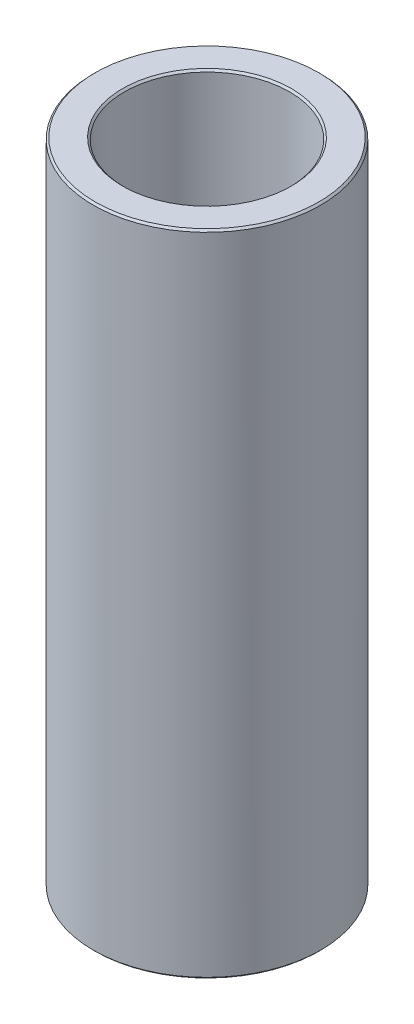
ISO-10303-21;
HEADER;
FILE_DESCRIPTION(('STEP AP214'),'2;1');
FILE_NAME('part.step','',(''),(''),'','','');
FILE_SCHEMA(('AUTOMOTIVE_DESIGN { 1 0 10303 214 1 1 1 1 }'));
ENDSEC;
DATA;
#1=APPLICATION_CONTEXT('core data for automotive mechanical design processes');
#2=APPLICATION_PROTOCOL_DEFINITION('international standard','automotive_design',2000,#1);
#3=PRODUCT_CONTEXT('',#1,'mechanical');
#4=PRODUCT('Part','Part','',(#3));
#5=PRODUCT_RELATED_PRODUCT_CATEGORY('part','',(#4));
#6=PRODUCT_DEFINITION_FORMATION('','',#4);
#7=PRODUCT_DEFINITION_CONTEXT('part definition',#1,'design');
#8=PRODUCT_DEFINITION('design','',#6,#7);
#9=PRODUCT_DEFINITION_SHAPE('','',#8);
#10=(LENGTH_UNIT() NAMED_UNIT(*) SI_UNIT(.MILLI.,.METRE.));
#11=(NAMED_UNIT(*) PLANE_ANGLE_UNIT() SI_UNIT($,.RADIAN.));
#12=(NAMED_UNIT(*) SI_UNIT($,.STERADIAN.) SOLID_ANGLE_UNIT());
#13=UNCERTAINTY_MEASURE_WITH_UNIT(LENGTH_MEASURE(1.E-05),#10,'distance_accuracy_value','');
#14=(GEOMETRIC_REPRESENTATION_CONTEXT(3) GLOBAL_UNCERTAINTY_ASSIGNED_CONTEXT((#13)) GLOBAL_UNIT_ASSIGNED_CONTEXT((#10,
#11,#12)) REPRESENTATION_CONTEXT('',''));
#15=CARTESIAN_POINT('',(0.,0.,0.));
#16=DIRECTION('',(0.,0.,1.));
#17=DIRECTION('',(1.,0.,0.));
#18=AXIS2_PLACEMENT_3D('',#15,#16,#17);
#19=CARTESIAN_POINT('',(0.,228.198416367854,0.));
#20=DIRECTION('',(0.,-1.,0.));
#21=DIRECTION('',(0.,0.,-1.));
#22=AXIS2_PLACEMENT_3D('',#19,#20,#21);
#23=CYLINDRICAL_SURFACE('',#22,40.);
#24=CARTESIAN_POINT('',(0.,0.655677355949763,0.));
#25=DIRECTION('',(0.,1.,0.));
#26=DIRECTION('',(0.,0.,1.));
#27=AXIS2_PLACEMENT_3D('',#24,#25,#26);
#28=CIRCLE('',#27,40.);
#29=CARTESIAN_POINT('',(0.,0.655677355949735,-40.));
#30=VERTEX_POINT('',#29);
#31=EDGE_CURVE('E10',#30,#30,#28,.T.);
#32=CARTESIAN_POINT('',(0.,227.542739011905,0.));
#33=DIRECTION('',(0.,1.,0.));
#34=DIRECTION('',(0.,0.,1.));
#35=AXIS2_PLACEMENT_3D('',#32,#33,#34);
#36=CIRCLE('',#35,40.);
#37=CARTESIAN_POINT('',(0.,227.542739011905,-40.));
#38=VERTEX_POINT('',#37);
#39=EDGE_CURVE('E50',#38,#38,#36,.F.);
#40=CARTESIAN_POINT('',(0.,0.655677355949735,-40.));
#41=CARTESIAN_POINT('',(0.,3.01908424819926,-40.));
#42=CARTESIAN_POINT('',(0.,5.38249114044879,-40.));
#43=CARTESIAN_POINT('',(0.,10.1093049249478,-40.));
#44=CARTESIAN_POINT('',(0.,12.4727118171974,-40.));
#45=CARTESIAN_POINT('',(0.,17.1995256016964,-40.));
#46=CARTESIAN_POINT('',(0.,19.562932493946,-40.));
#47=CARTESIAN_POINT('',(0.,24.289746278445,-40.));
#48=CARTESIAN_POINT('',(0.,26.6531531706946,-40.));
#49=CARTESIAN_POINT('',(0.,31.3799669551936,-40.));
#50=CARTESIAN_POINT('',(0.,33.7433738474431,-40.));
#51=CARTESIAN_POINT('',(0.,38.4701876319422,-40.));
#52=CARTESIAN_POINT('',(0.,40.8335945241917,-40.));
#53=CARTESIAN_POINT('',(0.,45.5604083086908,-40.));
#54=CARTESIAN_POINT('',(0.,47.9238152009403,-40.));
#55=CARTESIAN_POINT('',(0.,52.6506289854394,-40.));
#56=CARTESIAN_POINT('',(0.,55.0140358776889,-40.));
#57=CARTESIAN_POINT('',(0.,59.740849662188,-40.));
#58=CARTESIAN_POINT('',(0.,62.1042565544375,-40.));
#59=CARTESIAN_POINT('',(0.,66.8310703389366,-40.));
#60=CARTESIAN_POINT('',(0.,69.1944772311861,-40.));
#61=CARTESIAN_POINT('',(0.,73.9212910156851,-40.));
#62=CARTESIAN_POINT('',(0.,76.2846979079347,-40.));
#63=CARTESIAN_POINT('',(0.,81.0115116924337,-40.));
#64=CARTESIAN_POINT('',(0.,83.3749185846833,-40.));
#65=CARTESIAN_POINT('',(0.,88.1017323691823,-40.));
#66=CARTESIAN_POINT('',(0.,90.4651392614318,-40.));
#67=CARTESIAN_POINT('',(0.,95.1919530459309,-40.));
#68=CARTESIAN_POINT('',(0.,97.5553599381804,-40.));
#69=CARTESIAN_POINT('',(0.,102.282173722679,-40.));
#70=CARTESIAN_POINT('',(0.,104.645580614929,-40.));
#71=CARTESIAN_POINT('',(0.,109.372394399428,-40.));
#72=CARTESIAN_POINT('',(0.,111.735801291678,-40.));
#73=CARTESIAN_POINT('',(0.,116.462615076177,-40.));
#74=CARTESIAN_POINT('',(0.,118.826021968426,-40.));
#75=CARTESIAN_POINT('',(0.,123.552835752925,-40.));
#76=CARTESIAN_POINT('',(0.,125.916242645175,-40.));
#77=CARTESIAN_POINT('',(0.,130.643056429674,-40.));
#78=CARTESIAN_POINT('',(0.,133.006463321923,-40.));
#79=CARTESIAN_POINT('',(0.,137.733277106422,-40.));
#80=CARTESIAN_POINT('',(0.,140.096683998672,-40.));
#81=CARTESIAN_POINT('',(0.,144.823497783171,-40.));
#82=CARTESIAN_POINT('',(0.,147.186904675421,-40.));
#83=CARTESIAN_POINT('',(0.,151.91371845992,-40.));
#84=CARTESIAN_POINT('',(0.,154.277125352169,-40.));
#85=CARTESIAN_POINT('',(0.,159.003939136668,-40.));
#86=CARTESIAN_POINT('',(0.,161.367346028918,-40.));
#87=CARTESIAN_POINT('',(0.,166.094159813417,-40.));
#88=CARTESIAN_POINT('',(0.,168.457566705666,-40.));
#89=CARTESIAN_POINT('',(0.,173.184380490165,-40.));
#90=CARTESIAN_POINT('',(0.,175.547787382415,-40.));
#91=CARTESIAN_POINT('',(0.,180.274601166914,-40.));
#92=CARTESIAN_POINT('',(0.,182.638008059163,-40.));
#93=CARTESIAN_POINT('',(0.,187.364821843663,-40.));
#94=CARTESIAN_POINT('',(0.,189.728228735912,-40.));
#95=CARTESIAN_POINT('',(0.,194.455042520411,-40.));
#96=CARTESIAN_POINT('',(0.,196.818449412661,-40.));
#97=CARTESIAN_POINT('',(0.,201.54526319716,-40.));
#98=CARTESIAN_POINT('',(0.,203.908670089409,-40.));
#99=CARTESIAN_POINT('',(0.,208.635483873908,-40.));
#100=CARTESIAN_POINT('',(0.,210.998890766158,-40.));
#101=CARTESIAN_POINT('',(0.,215.725704550657,-40.));
#102=CARTESIAN_POINT('',(0.,218.089111442906,-40.));
#103=CARTESIAN_POINT('',(0.,222.815925227405,-40.));
#104=CARTESIAN_POINT('',(0.,225.179332119655,-40.));
#105=CARTESIAN_POINT('',(0.,227.542739011905,-40.));
#106=B_SPLINE_CURVE_WITH_KNOTS('',3,(#40,#41,#42,#43,#44,#45,#46,#47,#48,#49,#50,#51,#52,#53,
#54,#55,#56,#57,#58,#59,#60,#61,#62,#63,#64,#65,#66,#67,#68,#69,#70,#71,#72,#73,#74,#75,#76,#77,
#78,#79,#80,#81,#82,#83,#84,#85,#86,#87,#88,#89,#90,#91,#92,#93,#94,#95,#96,#97,#98,#99,#100,
#101,#102,#103,#104,#105),.UNSPECIFIED.,.F.,.F.,(4,2,2,2,2,2,2,2,2,2,2,2,2,2,2,2,2,2,2,2,2,2,2,
2,2,2,2,2,2,2,2,2,4),(0.,7.09022067674858,14.1804413534972,21.2706620302457,28.3608827069944,
35.4511033837429,42.5413240604915,49.6315447372401,56.7217654139887,63.8119860907373,
70.9022067674859,77.9924274442345,85.082648120983,92.1728687977316,99.2630894744802,
106.353310151229,113.443530827977,120.533751504726,127.623972181475,134.714192858223,
141.804413534972,148.89463421172,155.984854888469,163.075075565218,170.165296241966,
177.255516918715,184.345737595463,191.435958272212,198.52617894896,205.616399625709,
212.706620302458,219.796840979206,226.887061655955),.UNSPECIFIED.);
#107=EDGE_CURVE('BSEAM39',#30,#38,#106,.T.);
#108=ORIENTED_EDGE('',*,*,#31,.T.);
#109=ORIENTED_EDGE('',*,*,#39,.T.);
#110=ORIENTED_EDGE('',*,*,#107,.T.);
#111=ORIENTED_EDGE('',*,*,#107,.F.);
#112=EDGE_LOOP('',(#108,#110,#109,#111));
#113=FACE_BOUND('',#112,.T.);
#114=ADVANCED_FACE('F39',(#113),#23,.T.);
#115=CARTESIAN_POINT('',(0.,228.198416367854,0.));
#116=DIRECTION('',(0.,1.,0.));
#117=DIRECTION('',(0.,0.,1.));
#118=AXIS2_PLACEMENT_3D('',#115,#116,#117);
#119=PLANE('',#118);
#120=CARTESIAN_POINT('',(0.,228.198416367854,0.));
#121=DIRECTION('',(0.,1.,0.));
#122=DIRECTION('',(0.,0.,1.));
#123=AXIS2_PLACEMENT_3D('',#120,#121,#122);
#124=CIRCLE('',#123,29.7033499949594);
#125=CARTESIAN_POINT('',(0.,228.198416367854,29.7033499949594));
#126=VERTEX_POINT('',#125);
#127=EDGE_CURVE('E58',#126,#126,#124,.F.);
#128=ORIENTED_EDGE('',*,*,#127,.T.);
#129=EDGE_LOOP('',(#128));
#130=FACE_BOUND('',#129,.T.);
#131=CARTESIAN_POINT('',(0.,228.198416367854,0.));
#132=DIRECTION('',(0.,1.,0.));
#133=DIRECTION('',(0.,0.,1.));
#134=AXIS2_PLACEMENT_3D('',#131,#132,#133);
#135=CIRCLE('',#134,39.3443226440504);
#136=CARTESIAN_POINT('',(0.,228.198416367854,39.3443226440504));
#137=VERTEX_POINT('',#136);
#138=EDGE_CURVE('E61',#137,#137,#135,.T.);
#139=ORIENTED_EDGE('',*,*,#138,.T.);
#140=EDGE_LOOP('',(#139));
#141=FACE_BOUND('',#140,.T.);
#142=ADVANCED_FACE('F88',(#130,#141),#119,.T.);
#143=CARTESIAN_POINT('',(0.,0.,0.));
#144=DIRECTION('',(0.,1.,0.));
#145=DIRECTION('',(0.,0.,1.));
#146=AXIS2_PLACEMENT_3D('',#143,#144,#145);
#147=PLANE('',#146);
#148=CARTESIAN_POINT('',(0.,0.,0.));
#149=DIRECTION('',(0.,1.,0.));
#150=DIRECTION('',(0.,0.,1.));
#151=AXIS2_PLACEMENT_3D('',#148,#149,#150);
#152=CIRCLE('',#151,29.7033499949593);
#153=CARTESIAN_POINT('',(0.,0.,29.7033499949593));
#154=VERTEX_POINT('',#153);
#155=EDGE_CURVE('E51',#154,#154,#152,.T.);
#156=ORIENTED_EDGE('',*,*,#155,.T.);
#157=EDGE_LOOP('',(#156));
#158=FACE_BOUND('',#157,.T.);
#159=CARTESIAN_POINT('',(0.,0.,0.));
#160=DIRECTION('',(0.,1.,0.));
#161=DIRECTION('',(0.,0.,1.));
#162=AXIS2_PLACEMENT_3D('',#159,#160,#161);
#163=CIRCLE('',#162,39.3443226440502);
#164=CARTESIAN_POINT('',(0.,0.,39.3443226440502));
#165=VERTEX_POINT('',#164);
#166=EDGE_CURVE('E54',#165,#165,#163,.F.);
#167=ORIENTED_EDGE('',*,*,#166,.T.);
#168=EDGE_LOOP('',(#167));
#169=FACE_BOUND('',#168,.T.);
#170=ADVANCED_FACE('F83',(#158,#169),#147,.F.);
#171=CARTESIAN_POINT('',(0.,228.198416367854,0.));
#172=DIRECTION('',(0.,-1.,0.));
#173=DIRECTION('',(0.,0.,-1.));
#174=AXIS2_PLACEMENT_3D('',#171,#172,#173);
#175=CYLINDRICAL_SURFACE('',#174,29.0476726390097);
#176=CARTESIAN_POINT('',(0.,227.542739011904,0.));
#177=DIRECTION('',(0.,1.,0.));
#178=DIRECTION('',(0.,0.,1.));
#179=AXIS2_PLACEMENT_3D('',#176,#177,#178);
#180=CIRCLE('',#179,29.0476726390097);
#181=CARTESIAN_POINT('',(0.,227.542739011904,-29.0476726390097));
#182=VERTEX_POINT('',#181);
#183=EDGE_CURVE('E67',#182,#182,#180,.T.);
#184=CARTESIAN_POINT('',(0.,0.655677355949569,0.));
#185=DIRECTION('',(0.,1.,0.));
#186=DIRECTION('',(0.,0.,1.));
#187=AXIS2_PLACEMENT_3D('',#184,#185,#186);
#188=CIRCLE('',#187,29.0476726390097);
#189=CARTESIAN_POINT('',(0.,0.655677355949569,-29.0476726390097));
#190=VERTEX_POINT('',#189);
#191=EDGE_CURVE('E69',#190,#190,#188,.F.);
#192=CARTESIAN_POINT('',(0.,227.542739011904,-29.0476726390097));
#193=CARTESIAN_POINT('',(0.,225.179332119655,-29.0476726390097));
#194=CARTESIAN_POINT('',(0.,222.815925227405,-29.0476726390097));
#195=CARTESIAN_POINT('',(0.,218.089111442906,-29.0476726390097));
#196=CARTESIAN_POINT('',(0.,215.725704550657,-29.0476726390097));
#197=CARTESIAN_POINT('',(0.,210.998890766158,-29.0476726390097));
#198=CARTESIAN_POINT('',(0.,208.635483873908,-29.0476726390097));
#199=CARTESIAN_POINT('',(0.,203.908670089409,-29.0476726390097));
#200=CARTESIAN_POINT('',(0.,201.54526319716,-29.0476726390097));
#201=CARTESIAN_POINT('',(0.,196.818449412661,-29.0476726390097));
#202=CARTESIAN_POINT('',(0.,194.455042520411,-29.0476726390097));
#203=CARTESIAN_POINT('',(0.,189.728228735912,-29.0476726390097));
#204=CARTESIAN_POINT('',(0.,187.364821843662,-29.0476726390097));
#205=CARTESIAN_POINT('',(0.,182.638008059163,-29.0476726390097));
#206=CARTESIAN_POINT('',(0.,180.274601166914,-29.0476726390097));
#207=CARTESIAN_POINT('',(0.,175.547787382415,-29.0476726390097));
#208=CARTESIAN_POINT('',(0.,173.184380490165,-29.0476726390097));
#209=CARTESIAN_POINT('',(0.,168.457566705666,-29.0476726390097));
#210=CARTESIAN_POINT('',(0.,166.094159813417,-29.0476726390097));
#211=CARTESIAN_POINT('',(0.,161.367346028918,-29.0476726390097));
#212=CARTESIAN_POINT('',(0.,159.003939136668,-29.0476726390097));
#213=CARTESIAN_POINT('',(0.,154.277125352169,-29.0476726390097));
#214=CARTESIAN_POINT('',(0.,151.913718459919,-29.0476726390097));
#215=CARTESIAN_POINT('',(0.,147.18690467542,-29.0476726390097));
#216=CARTESIAN_POINT('',(0.,144.823497783171,-29.0476726390097));
#217=CARTESIAN_POINT('',(0.,140.096683998672,-29.0476726390097));
#218=CARTESIAN_POINT('',(0.,137.733277106422,-29.0476726390097));
#219=CARTESIAN_POINT('',(0.,133.006463321923,-29.0476726390097));
#220=CARTESIAN_POINT('',(0.,130.643056429674,-29.0476726390097));
#221=CARTESIAN_POINT('',(0.,125.916242645175,-29.0476726390097));
#222=CARTESIAN_POINT('',(0.,123.552835752925,-29.0476726390097));
#223=CARTESIAN_POINT('',(0.,118.826021968426,-29.0476726390097));
#224=CARTESIAN_POINT('',(0.,116.462615076177,-29.0476726390097));
#225=CARTESIAN_POINT('',(0.,111.735801291677,-29.0476726390097));
#226=CARTESIAN_POINT('',(0.,109.372394399428,-29.0476726390097));
#227=CARTESIAN_POINT('',(0.,104.645580614929,-29.0476726390097));
#228=CARTESIAN_POINT('',(0.,102.282173722679,-29.0476726390097));
#229=CARTESIAN_POINT('',(0.,97.5553599381803,-29.0476726390097));
#230=CARTESIAN_POINT('',(0.,95.1919530459308,-29.0476726390097));
#231=CARTESIAN_POINT('',(0.,90.4651392614317,-29.0476726390097));
#232=CARTESIAN_POINT('',(0.,88.1017323691822,-29.0476726390097));
#233=CARTESIAN_POINT('',(0.,83.3749185846831,-29.0476726390097));
#234=CARTESIAN_POINT('',(0.,81.0115116924336,-29.0476726390097));
#235=CARTESIAN_POINT('',(0.,76.2846979079345,-29.0476726390097));
#236=CARTESIAN_POINT('',(0.,73.921291015685,-29.0476726390097));
#237=CARTESIAN_POINT('',(0.,69.1944772311859,-29.0476726390097));
#238=CARTESIAN_POINT('',(0.,66.8310703389364,-29.0476726390097));
#239=CARTESIAN_POINT('',(0.,62.1042565544373,-29.0476726390097));
#240=CARTESIAN_POINT('',(0.,59.7408496621878,-29.0476726390097));
#241=CARTESIAN_POINT('',(0.,55.0140358776887,-29.0476726390097));
#242=CARTESIAN_POINT('',(0.,52.6506289854392,-29.0476726390097));
#243=CARTESIAN_POINT('',(0.,47.9238152009402,-29.0476726390097));
#244=CARTESIAN_POINT('',(0.,45.5604083086906,-29.0476726390097));
#245=CARTESIAN_POINT('',(0.,40.8335945241916,-29.0476726390097));
#246=CARTESIAN_POINT('',(0.,38.4701876319421,-29.0476726390097));
#247=CARTESIAN_POINT('',(0.,33.743373847443,-29.0476726390097));
#248=CARTESIAN_POINT('',(0.,31.3799669551934,-29.0476726390097));
#249=CARTESIAN_POINT('',(0.,26.6531531706944,-29.0476726390097));
#250=CARTESIAN_POINT('',(0.,24.2897462784448,-29.0476726390097));
#251=CARTESIAN_POINT('',(0.,19.5629324939458,-29.0476726390097));
#252=CARTESIAN_POINT('',(0.,17.1995256016963,-29.0476726390097));
#253=CARTESIAN_POINT('',(0.,12.4727118171972,-29.0476726390097));
#254=CARTESIAN_POINT('',(0.,10.1093049249477,-29.0476726390097));
#255=CARTESIAN_POINT('',(0.,5.38249114044862,-29.0476726390097));
#256=CARTESIAN_POINT('',(0.,3.0190842481991,-29.0476726390097));
#257=CARTESIAN_POINT('',(0.,0.655677355949569,-29.0476726390097));
#258=B_SPLINE_CURVE_WITH_KNOTS('',3,(#192,#193,#194,#195,#196,#197,#198,#199,#200,#201,#202,
#203,#204,#205,#206,#207,#208,#209,#210,#211,#212,#213,#214,#215,#216,#217,#218,#219,#220,#221,
#222,#223,#224,#225,#226,#227,#228,#229,#230,#231,#232,#233,#234,#235,#236,#237,#238,#239,#240,
#241,#242,#243,#244,#245,#246,#247,#248,#249,#250,#251,#252,#253,#254,#255,#256,#257),
.UNSPECIFIED.,.F.,.F.,(4,2,2,2,2,2,2,2,2,2,2,2,2,2,2,2,2,2,2,2,2,2,2,2,2,2,2,2,2,2,2,2,4),(0.,
7.09022067674861,14.1804413534972,21.2706620302458,28.3608827069944,35.451103383743,
42.5413240604915,49.6315447372402,56.7217654139887,63.8119860907373,70.9022067674859,
77.9924274442345,85.0826481209831,92.1728687977317,99.2630894744803,106.353310151229,
113.443530827977,120.533751504726,127.623972181475,134.714192858223,141.804413534972,
148.89463421172,155.984854888469,163.075075565218,170.165296241966,177.255516918715,
184.345737595463,191.435958272212,198.526178948961,205.616399625709,212.706620302458,
219.796840979206,226.887061655955),.UNSPECIFIED.);
#259=EDGE_CURVE('BSEAM71',#182,#190,#258,.T.);
#260=ORIENTED_EDGE('',*,*,#183,.T.);
#261=ORIENTED_EDGE('',*,*,#191,.T.);
#262=ORIENTED_EDGE('',*,*,#259,.T.);
#263=ORIENTED_EDGE('',*,*,#259,.F.);
#264=EDGE_LOOP('',(#260,#262,#261,#263));
#265=FACE_BOUND('',#264,.T.);
#266=ADVANCED_FACE('F71',(#265),#175,.F.);
#267=CARTESIAN_POINT('',(0.,227.542739011904,0.));
#268=DIRECTION('',(0.,1.,0.));
#269=DIRECTION('',(0.,0.,1.));
#270=AXIS2_PLACEMENT_3D('',#267,#268,#269);
#271=CONICAL_SURFACE('',#270,29.0476726390097,0.78539816339744);
#272=ORIENTED_EDGE('',*,*,#127,.F.);
#273=EDGE_LOOP('',(#272));
#274=FACE_BOUND('',#273,.T.);
#275=ORIENTED_EDGE('',*,*,#183,.F.);
#276=EDGE_LOOP('',(#275));
#277=FACE_BOUND('',#276,.T.);
#278=ADVANCED_FACE('F77',(#274,#277),#271,.F.);
#279=CARTESIAN_POINT('',(0.,0.,0.));
#280=DIRECTION('',(0.,-1.,0.));
#281=DIRECTION('',(0.,0.,-1.));
#282=AXIS2_PLACEMENT_3D('',#279,#280,#281);
#283=CONICAL_SURFACE('',#282,29.7033499949593,0.785398163397462);
#284=ORIENTED_EDGE('',*,*,#191,.F.);
#285=EDGE_LOOP('',(#284));
#286=FACE_BOUND('',#285,.T.);
#287=ORIENTED_EDGE('',*,*,#155,.F.);
#288=EDGE_LOOP('',(#287));
#289=FACE_BOUND('',#288,.T.);
#290=ADVANCED_FACE('F73',(#286,#289),#283,.F.);
#291=CARTESIAN_POINT('',(0.,0.655677355949763,0.));
#292=DIRECTION('',(0.,1.,0.));
#293=DIRECTION('',(0.,0.,1.));
#294=AXIS2_PLACEMENT_3D('',#291,#292,#293);
#295=CONICAL_SURFACE('',#294,40.,0.785398163397448);
#296=ORIENTED_EDGE('',*,*,#166,.F.);
#297=EDGE_LOOP('',(#296));
#298=FACE_BOUND('',#297,.T.);
#299=ORIENTED_EDGE('',*,*,#31,.F.);
#300=EDGE_LOOP('',(#299));
#301=FACE_BOUND('',#300,.T.);
#302=ADVANCED_FACE('F76',(#298,#301),#295,.T.);
#303=CARTESIAN_POINT('',(0.,228.198416367854,0.));
#304=DIRECTION('',(0.,-1.,0.));
#305=DIRECTION('',(0.,0.,-1.));
#306=AXIS2_PLACEMENT_3D('',#303,#304,#305);
#307=CONICAL_SURFACE('',#306,39.3443226440504,0.785398163397448);
#308=ORIENTED_EDGE('',*,*,#39,.F.);
#309=EDGE_LOOP('',(#308));
#310=FACE_BOUND('',#309,.T.);
#311=ORIENTED_EDGE('',*,*,#138,.F.);
#312=EDGE_LOOP('',(#311));
#313=FACE_BOUND('',#312,.T.);
#314=ADVANCED_FACE('F45',(#310,#313),#307,.T.);
#315=CLOSED_SHELL('',(#114,#142,#170,#266,#278,#290,#302,#314));
#316=MANIFOLD_SOLID_BREP('B2',#315);
#317=ADVANCED_BREP_SHAPE_REPRESENTATION('',(#18,#316),#14);
#318=SHAPE_DEFINITION_REPRESENTATION(#9,#317);
ENDSEC;
END-ISO-10303-21;
